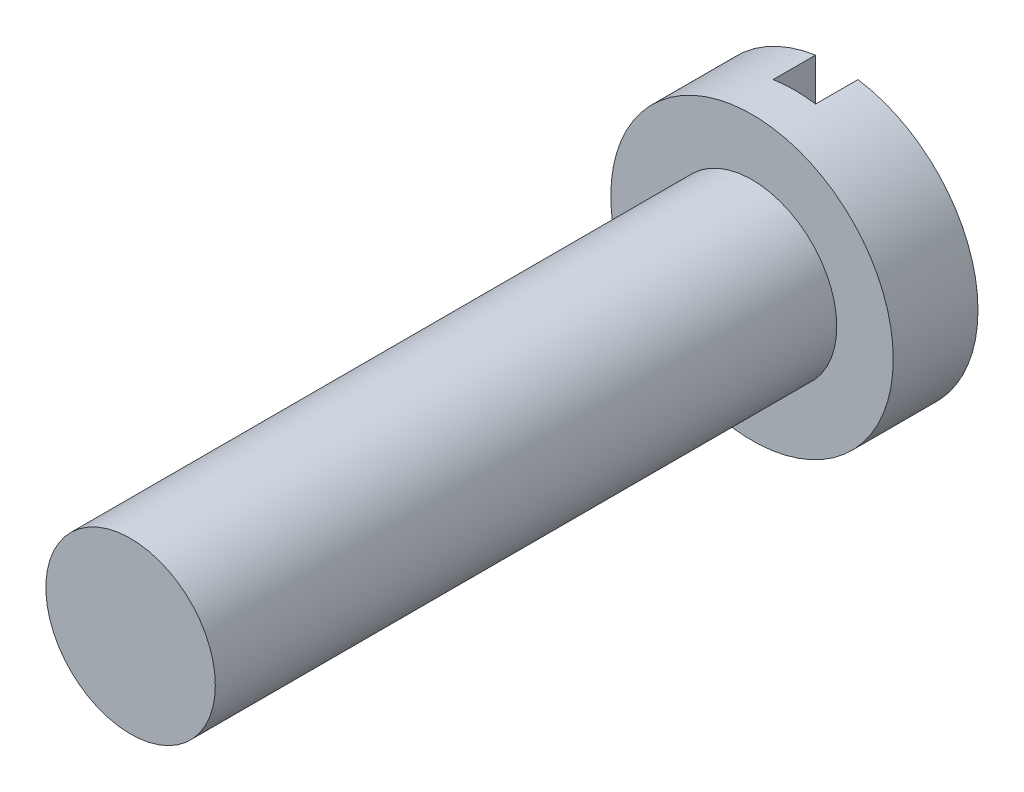
ISO-10303-21;
HEADER;
FILE_DESCRIPTION(('STEP AP214'),'2;1');
FILE_NAME('part.step','',(''),(''),'','','');
FILE_SCHEMA(('AUTOMOTIVE_DESIGN { 1 0 10303 214 1 1 1 1 }'));
ENDSEC;
DATA;
#1=APPLICATION_CONTEXT('core data for automotive mechanical design processes');
#2=APPLICATION_PROTOCOL_DEFINITION('international standard','automotive_design',2000,#1);
#3=PRODUCT_CONTEXT('',#1,'mechanical');
#4=PRODUCT('Part','Part','',(#3));
#5=PRODUCT_RELATED_PRODUCT_CATEGORY('part','',(#4));
#6=PRODUCT_DEFINITION_FORMATION('','',#4);
#7=PRODUCT_DEFINITION_CONTEXT('part definition',#1,'design');
#8=PRODUCT_DEFINITION('design','',#6,#7);
#9=PRODUCT_DEFINITION_SHAPE('','',#8);
#10=(LENGTH_UNIT() NAMED_UNIT(*) SI_UNIT(.MILLI.,.METRE.));
#11=(NAMED_UNIT(*) PLANE_ANGLE_UNIT() SI_UNIT($,.RADIAN.));
#12=(NAMED_UNIT(*) SI_UNIT($,.STERADIAN.) SOLID_ANGLE_UNIT());
#13=UNCERTAINTY_MEASURE_WITH_UNIT(LENGTH_MEASURE(1.E-05),#10,'distance_accuracy_value','');
#14=(GEOMETRIC_REPRESENTATION_CONTEXT(3) GLOBAL_UNCERTAINTY_ASSIGNED_CONTEXT((#13)) GLOBAL_UNIT_ASSIGNED_CONTEXT((#10,
#11,#12)) REPRESENTATION_CONTEXT('',''));
#15=CARTESIAN_POINT('',(0.,0.,0.));
#16=DIRECTION('',(0.,0.,1.));
#17=DIRECTION('',(1.,0.,0.));
#18=AXIS2_PLACEMENT_3D('',#15,#16,#17);
#19=CARTESIAN_POINT('',(0.,0.,-3.));
#20=DIRECTION('',(0.,0.,1.));
#21=DIRECTION('',(1.,0.,0.));
#22=AXIS2_PLACEMENT_3D('',#19,#20,#21);
#23=PLANE('',#22);
#24=CARTESIAN_POINT('',(0.,0.,-3.));
#25=DIRECTION('',(0.,0.,1.));
#26=DIRECTION('',(1.,0.,0.));
#27=AXIS2_PLACEMENT_3D('',#24,#25,#26);
#28=CIRCLE('',#27,5.);
#29=CARTESIAN_POINT('',(0.75,-4.9434299833213,-3.));
#30=VERTEX_POINT('',#29);
#31=CARTESIAN_POINT('',(0.75,4.9434299833213,-3.));
#32=VERTEX_POINT('',#31);
#33=EDGE_CURVE('E100',#30,#32,#28,.T.);
#34=ORIENTED_EDGE('',*,*,#33,.F.);
#35=DIRECTION('',(0.,1.,0.));
#36=VECTOR('',#35,1.);
#37=CARTESIAN_POINT('',(0.75,0.,-3.));
#38=LINE('',#37,#36);
#39=EDGE_CURVE('E87',#30,#32,#38,.T.);
#40=ORIENTED_EDGE('',*,*,#39,.T.);
#41=EDGE_LOOP('',(#34,#40));
#42=FACE_BOUND('',#41,.T.);
#43=ADVANCED_FACE('F39',(#42),#23,.F.);
#44=CARTESIAN_POINT('',(0.,0.,22.));
#45=DIRECTION('',(0.,0.,-1.));
#46=DIRECTION('',(-1.,0.,0.));
#47=AXIS2_PLACEMENT_3D('',#44,#45,#46);
#48=CYLINDRICAL_SURFACE('',#47,3.);
#49=CARTESIAN_POINT('',(0.,0.,22.));
#50=DIRECTION('',(0.,0.,1.));
#51=DIRECTION('',(1.,0.,0.));
#52=AXIS2_PLACEMENT_3D('',#49,#50,#51);
#53=CIRCLE('',#52,3.);
#54=CARTESIAN_POINT('',(3.,0.,22.));
#55=VERTEX_POINT('',#54);
#56=EDGE_CURVE('E88',#55,#55,#53,.T.);
#57=ORIENTED_EDGE('',*,*,#56,.F.);
#58=EDGE_LOOP('',(#57));
#59=FACE_BOUND('',#58,.T.);
#60=CARTESIAN_POINT('',(0.,0.,0.));
#61=DIRECTION('',(0.,0.,1.));
#62=DIRECTION('',(1.,0.,0.));
#63=AXIS2_PLACEMENT_3D('',#60,#61,#62);
#64=CIRCLE('',#63,3.);
#65=CARTESIAN_POINT('',(3.,0.,0.));
#66=VERTEX_POINT('',#65);
#67=EDGE_CURVE('E99',#66,#66,#64,.T.);
#68=ORIENTED_EDGE('',*,*,#67,.T.);
#69=EDGE_LOOP('',(#68));
#70=FACE_BOUND('',#69,.T.);
#71=ADVANCED_FACE('F41',(#59,#70),#48,.T.);
#72=CARTESIAN_POINT('',(0.,0.,22.));
#73=DIRECTION('',(0.,0.,1.));
#74=DIRECTION('',(1.,0.,0.));
#75=AXIS2_PLACEMENT_3D('',#72,#73,#74);
#76=PLANE('',#75);
#77=ORIENTED_EDGE('',*,*,#56,.T.);
#78=EDGE_LOOP('',(#77));
#79=FACE_BOUND('',#78,.T.);
#80=ADVANCED_FACE('F138',(#79),#76,.T.);
#81=CARTESIAN_POINT('',(0.,0.,0.));
#82=DIRECTION('',(0.,0.,1.));
#83=DIRECTION('',(1.,0.,0.));
#84=AXIS2_PLACEMENT_3D('',#81,#82,#83);
#85=PLANE('',#84);
#86=CARTESIAN_POINT('',(0.,0.,0.));
#87=DIRECTION('',(0.,0.,1.));
#88=DIRECTION('',(1.,0.,0.));
#89=AXIS2_PLACEMENT_3D('',#86,#87,#88);
#90=CIRCLE('',#89,5.);
#91=CARTESIAN_POINT('',(5.,0.,0.));
#92=VERTEX_POINT('',#91);
#93=EDGE_CURVE('E105',#92,#92,#90,.T.);
#94=ORIENTED_EDGE('',*,*,#93,.T.);
#95=EDGE_LOOP('',(#94));
#96=FACE_BOUND('',#95,.T.);
#97=ORIENTED_EDGE('',*,*,#67,.F.);
#98=EDGE_LOOP('',(#97));
#99=FACE_BOUND('',#98,.T.);
#100=ADVANCED_FACE('F141',(#96,#99),#85,.T.);
#101=CARTESIAN_POINT('',(0.,0.,-3.));
#102=DIRECTION('',(0.,0.,1.));
#103=DIRECTION('',(1.,0.,0.));
#104=AXIS2_PLACEMENT_3D('',#101,#102,#103);
#105=CYLINDRICAL_SURFACE('',#104,5.);
#106=DIRECTION('',(0.,0.,1.));
#107=VECTOR('',#106,1.);
#108=CARTESIAN_POINT('',(0.75,-4.9434299833213,-3.));
#109=LINE('',#108,#107);
#110=CARTESIAN_POINT('',(0.75,-4.9434299833213,-1.5));
#111=VERTEX_POINT('',#110);
#112=EDGE_CURVE('E62',#30,#111,#109,.T.);
#113=ORIENTED_EDGE('',*,*,#112,.F.);
#114=ORIENTED_EDGE('',*,*,#33,.T.);
#115=DIRECTION('',(0.,0.,1.));
#116=VECTOR('',#115,1.);
#117=CARTESIAN_POINT('',(0.75,4.9434299833213,-3.));
#118=LINE('',#117,#116);
#119=CARTESIAN_POINT('',(0.75,4.9434299833213,-1.5));
#120=VERTEX_POINT('',#119);
#121=EDGE_CURVE('E108',#120,#32,#118,.F.);
#122=ORIENTED_EDGE('',*,*,#121,.F.);
#123=CARTESIAN_POINT('',(0.,0.,-1.5));
#124=DIRECTION('',(0.,0.,-1.));
#125=DIRECTION('',(-1.,0.,0.));
#126=AXIS2_PLACEMENT_3D('',#123,#124,#125);
#127=CIRCLE('',#126,5.);
#128=CARTESIAN_POINT('',(-0.75,4.9434299833213,-1.5));
#129=VERTEX_POINT('',#128);
#130=EDGE_CURVE('E43',#120,#129,#127,.F.);
#131=ORIENTED_EDGE('',*,*,#130,.T.);
#132=DIRECTION('',(0.,0.,1.));
#133=VECTOR('',#132,1.);
#134=CARTESIAN_POINT('',(-0.75,4.9434299833213,-3.));
#135=LINE('',#134,#133);
#136=CARTESIAN_POINT('',(-0.75,4.9434299833213,-3.));
#137=VERTEX_POINT('',#136);
#138=EDGE_CURVE('E82',#137,#129,#135,.T.);
#139=ORIENTED_EDGE('',*,*,#138,.F.);
#140=CARTESIAN_POINT('',(-0.75,-4.9434299833213,-3.));
#141=VERTEX_POINT('',#140);
#142=EDGE_CURVE('E94',#137,#141,#28,.T.);
#143=ORIENTED_EDGE('',*,*,#142,.T.);
#144=DIRECTION('',(0.,0.,1.));
#145=VECTOR('',#144,1.);
#146=CARTESIAN_POINT('',(-0.75,-4.9434299833213,-3.));
#147=LINE('',#146,#145);
#148=CARTESIAN_POINT('',(-0.75,-4.9434299833213,-1.5));
#149=VERTEX_POINT('',#148);
#150=EDGE_CURVE('E54',#149,#141,#147,.F.);
#151=ORIENTED_EDGE('',*,*,#150,.F.);
#152=EDGE_CURVE('E11',#149,#111,#127,.F.);
#153=ORIENTED_EDGE('',*,*,#152,.T.);
#154=EDGE_LOOP('',(#113,#114,#122,#131,#139,#143,#151,#153));
#155=FACE_BOUND('',#154,.T.);
#156=ORIENTED_EDGE('',*,*,#93,.F.);
#157=EDGE_LOOP('',(#156));
#158=FACE_BOUND('',#157,.T.);
#159=ADVANCED_FACE('F92',(#155,#158),#105,.T.);
#160=ORIENTED_EDGE('',*,*,#142,.F.);
#161=DIRECTION('',(0.,-1.,0.));
#162=VECTOR('',#161,1.);
#163=CARTESIAN_POINT('',(-0.75,0.,-3.));
#164=LINE('',#163,#162);
#165=EDGE_CURVE('E79',#137,#141,#164,.T.);
#166=ORIENTED_EDGE('',*,*,#165,.T.);
#167=EDGE_LOOP('',(#160,#166));
#168=FACE_BOUND('',#167,.T.);
#169=ADVANCED_FACE('F98',(#168),#23,.F.);
#170=CARTESIAN_POINT('',(0.75,-5.,-1.5));
#171=DIRECTION('',(1.,0.,0.));
#172=DIRECTION('',(0.,0.,-1.));
#173=AXIS2_PLACEMENT_3D('',#170,#171,#172);
#174=PLANE('',#173);
#175=ORIENTED_EDGE('',*,*,#121,.T.);
#176=ORIENTED_EDGE('',*,*,#39,.F.);
#177=ORIENTED_EDGE('',*,*,#112,.T.);
#178=DIRECTION('',(0.,-1.,0.));
#179=VECTOR('',#178,1.);
#180=CARTESIAN_POINT('',(0.75,-5.,-1.5));
#181=LINE('',#180,#179);
#182=EDGE_CURVE('E119',#120,#111,#181,.T.);
#183=ORIENTED_EDGE('',*,*,#182,.F.);
#184=EDGE_LOOP('',(#175,#176,#177,#183));
#185=FACE_BOUND('',#184,.T.);
#186=ADVANCED_FACE('F122',(#185),#174,.F.);
#187=CARTESIAN_POINT('',(-0.75,-5.,-1.5));
#188=DIRECTION('',(-1.,0.,0.));
#189=DIRECTION('',(0.,0.,1.));
#190=AXIS2_PLACEMENT_3D('',#187,#188,#189);
#191=PLANE('',#190);
#192=ORIENTED_EDGE('',*,*,#150,.T.);
#193=ORIENTED_EDGE('',*,*,#165,.F.);
#194=ORIENTED_EDGE('',*,*,#138,.T.);
#195=DIRECTION('',(0.,1.,0.));
#196=VECTOR('',#195,1.);
#197=CARTESIAN_POINT('',(-0.75,-5.,-1.5));
#198=LINE('',#197,#196);
#199=EDGE_CURVE('E96',#149,#129,#198,.T.);
#200=ORIENTED_EDGE('',*,*,#199,.F.);
#201=EDGE_LOOP('',(#192,#193,#194,#200));
#202=FACE_BOUND('',#201,.T.);
#203=ADVANCED_FACE('F81',(#202),#191,.F.);
#204=CARTESIAN_POINT('',(0.,0.,-1.5));
#205=DIRECTION('',(0.,0.,-1.));
#206=DIRECTION('',(-1.,0.,0.));
#207=AXIS2_PLACEMENT_3D('',#204,#205,#206);
#208=PLANE('',#207);
#209=ORIENTED_EDGE('',*,*,#199,.T.);
#210=ORIENTED_EDGE('',*,*,#130,.F.);
#211=ORIENTED_EDGE('',*,*,#182,.T.);
#212=ORIENTED_EDGE('',*,*,#152,.F.);
#213=EDGE_LOOP('',(#209,#210,#211,#212));
#214=FACE_BOUND('',#213,.T.);
#215=ADVANCED_FACE('F121',(#214),#208,.T.);
#216=CLOSED_SHELL('',(#43,#71,#80,#100,#159,#169,#186,#203,#215));
#217=MANIFOLD_SOLID_BREP('B2',#216);
#218=ADVANCED_BREP_SHAPE_REPRESENTATION('',(#18,#217),#14);
#219=SHAPE_DEFINITION_REPRESENTATION(#9,#218);
ENDSEC;
END-ISO-10303-21;
